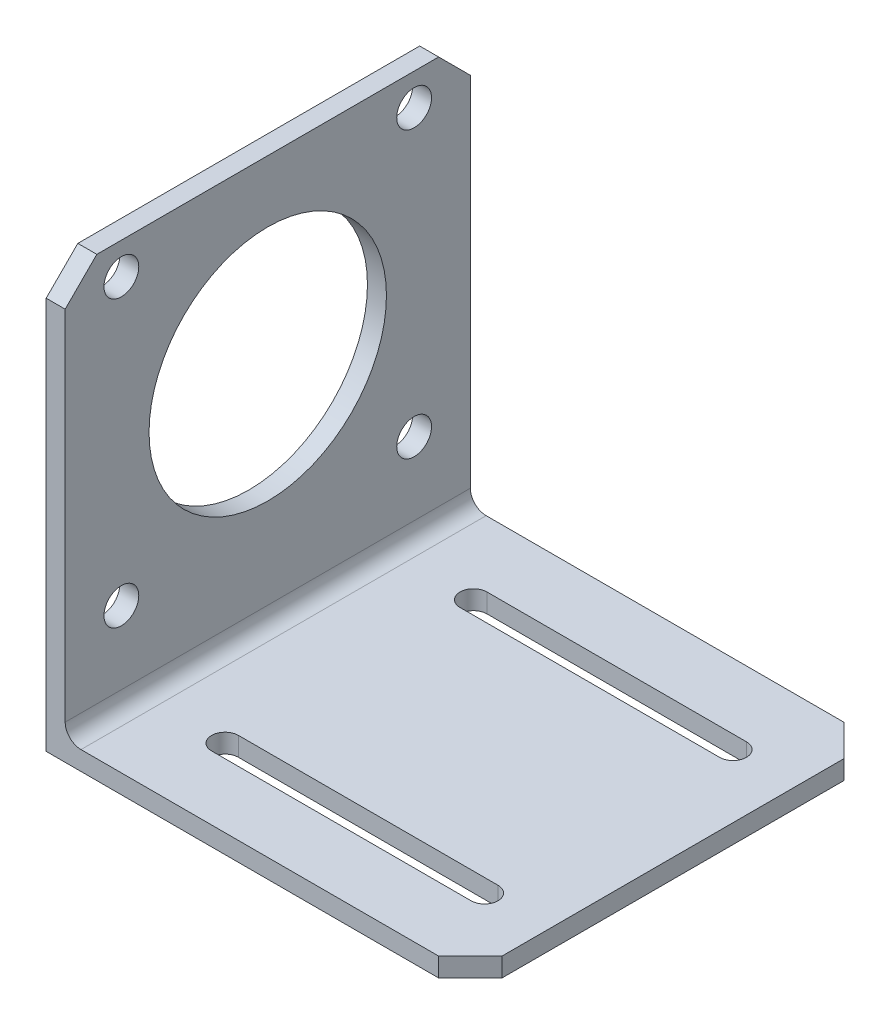
ISO-10303-21;
HEADER;
FILE_DESCRIPTION(('STEP AP214'),'2;1');
FILE_NAME('part.step','',(''),(''),'','','');
FILE_SCHEMA(('AUTOMOTIVE_DESIGN { 1 0 10303 214 1 1 1 1 }'));
ENDSEC;
DATA;
#1=APPLICATION_CONTEXT('core data for automotive mechanical design processes');
#2=APPLICATION_PROTOCOL_DEFINITION('international standard','automotive_design',2000,#1);
#3=PRODUCT_CONTEXT('',#1,'mechanical');
#4=PRODUCT('Part','Part','',(#3));
#5=PRODUCT_RELATED_PRODUCT_CATEGORY('part','',(#4));
#6=PRODUCT_DEFINITION_FORMATION('','',#4);
#7=PRODUCT_DEFINITION_CONTEXT('part definition',#1,'design');
#8=PRODUCT_DEFINITION('design','',#6,#7);
#9=PRODUCT_DEFINITION_SHAPE('','',#8);
#10=(LENGTH_UNIT() NAMED_UNIT(*) SI_UNIT(.MILLI.,.METRE.));
#11=(NAMED_UNIT(*) PLANE_ANGLE_UNIT() SI_UNIT($,.RADIAN.));
#12=(NAMED_UNIT(*) SI_UNIT($,.STERADIAN.) SOLID_ANGLE_UNIT());
#13=UNCERTAINTY_MEASURE_WITH_UNIT(LENGTH_MEASURE(1.E-05),#10,'distance_accuracy_value','');
#14=(GEOMETRIC_REPRESENTATION_CONTEXT(3) GLOBAL_UNCERTAINTY_ASSIGNED_CONTEXT((#13)) GLOBAL_UNIT_ASSIGNED_CONTEXT((#10,
#11,#12)) REPRESENTATION_CONTEXT('',''));
#15=CARTESIAN_POINT('',(0.,0.,0.));
#16=DIRECTION('',(0.,0.,1.));
#17=DIRECTION('',(1.,0.,0.));
#18=AXIS2_PLACEMENT_3D('',#15,#16,#17);
#19=CARTESIAN_POINT('',(1.524,-32.512,-65.024));
#20=DIRECTION('',(0.,1.,0.));
#21=DIRECTION('',(-1.,0.,0.));
#22=AXIS2_PLACEMENT_3D('',#19,#20,#21);
#23=PLANE('',#22);
#24=CARTESIAN_POINT('',(14.732,-32.512,-52.324));
#25=DIRECTION('',(0.,1.,0.));
#26=DIRECTION('',(1.,0.,0.));
#27=AXIS2_PLACEMENT_3D('',#24,#25,#26);
#28=CIRCLE('',#27,2.159);
#29=CARTESIAN_POINT('',(14.732,-32.512,-54.483));
#30=VERTEX_POINT('',#29);
#31=CARTESIAN_POINT('',(14.732,-32.512,-50.165));
#32=VERTEX_POINT('',#31);
#33=EDGE_CURVE('E186',#30,#32,#28,.T.);
#34=ORIENTED_EDGE('',*,*,#33,.F.);
#35=DIRECTION('',(-1.,0.,0.));
#36=VECTOR('',#35,1.);
#37=CARTESIAN_POINT('',(14.732,-32.512,-54.483));
#38=LINE('',#37,#36);
#39=CARTESIAN_POINT('',(56.388,-32.512,-54.483));
#40=VERTEX_POINT('',#39);
#41=EDGE_CURVE('E190',#40,#30,#38,.T.);
#42=ORIENTED_EDGE('',*,*,#41,.F.);
#43=CARTESIAN_POINT('',(56.388,-32.512,-52.324));
#44=DIRECTION('',(0.,1.,0.));
#45=DIRECTION('',(1.,0.,0.));
#46=AXIS2_PLACEMENT_3D('',#43,#44,#45);
#47=CIRCLE('',#46,2.159);
#48=CARTESIAN_POINT('',(56.388,-32.512,-50.165));
#49=VERTEX_POINT('',#48);
#50=EDGE_CURVE('E170',#49,#40,#47,.T.);
#51=ORIENTED_EDGE('',*,*,#50,.F.);
#52=DIRECTION('',(1.,0.,0.));
#53=VECTOR('',#52,1.);
#54=CARTESIAN_POINT('',(14.732,-32.512,-50.165));
#55=LINE('',#54,#53);
#56=EDGE_CURVE('E181',#32,#49,#55,.T.);
#57=ORIENTED_EDGE('',*,*,#56,.F.);
#58=EDGE_LOOP('',(#34,#42,#51,#57));
#59=FACE_BOUND('',#58,.T.);
#60=CARTESIAN_POINT('',(14.732,-32.512,-12.446));
#61=DIRECTION('',(0.,1.,0.));
#62=DIRECTION('',(-1.,0.,0.));
#63=AXIS2_PLACEMENT_3D('',#60,#61,#62);
#64=CIRCLE('',#63,2.159);
#65=CARTESIAN_POINT('',(14.732,-32.512,-14.605));
#66=VERTEX_POINT('',#65);
#67=CARTESIAN_POINT('',(14.732,-32.512,-10.287));
#68=VERTEX_POINT('',#67);
#69=EDGE_CURVE('E197',#66,#68,#64,.T.);
#70=ORIENTED_EDGE('',*,*,#69,.F.);
#71=DIRECTION('',(-1.,0.,0.));
#72=VECTOR('',#71,1.);
#73=CARTESIAN_POINT('',(14.732,-32.512,-14.605));
#74=LINE('',#73,#72);
#75=CARTESIAN_POINT('',(56.388,-32.512,-14.605));
#76=VERTEX_POINT('',#75);
#77=EDGE_CURVE('E207',#76,#66,#74,.T.);
#78=ORIENTED_EDGE('',*,*,#77,.F.);
#79=CARTESIAN_POINT('',(56.388,-32.512,-12.446));
#80=DIRECTION('',(0.,1.,0.));
#81=DIRECTION('',(1.,0.,0.));
#82=AXIS2_PLACEMENT_3D('',#79,#80,#81);
#83=CIRCLE('',#82,2.159);
#84=CARTESIAN_POINT('',(56.388,-32.512,-10.287));
#85=VERTEX_POINT('',#84);
#86=EDGE_CURVE('E204',#85,#76,#83,.T.);
#87=ORIENTED_EDGE('',*,*,#86,.F.);
#88=DIRECTION('',(1.,0.,0.));
#89=VECTOR('',#88,1.);
#90=CARTESIAN_POINT('',(14.732,-32.512,-10.287));
#91=LINE('',#90,#89);
#92=EDGE_CURVE('E201',#68,#85,#91,.T.);
#93=ORIENTED_EDGE('',*,*,#92,.F.);
#94=EDGE_LOOP('',(#70,#78,#87,#93));
#95=FACE_BOUND('',#94,.T.);
#96=DIRECTION('',(0.,0.,1.));
#97=VECTOR('',#96,1.);
#98=CARTESIAN_POINT('',(66.548,-32.512,-65.024));
#99=LINE('',#98,#97);
#100=CARTESIAN_POINT('',(66.548,-32.512,-59.944));
#101=VERTEX_POINT('',#100);
#102=CARTESIAN_POINT('',(66.548,-32.512,-5.08000000000003));
#103=VERTEX_POINT('',#102);
#104=EDGE_CURVE('E240',#101,#103,#99,.T.);
#105=ORIENTED_EDGE('',*,*,#104,.F.);
#106=DIRECTION('',(0.707106781186548,0.,0.707106781186547));
#107=VECTOR('',#106,1.);
#108=CARTESIAN_POINT('',(31.4959999999999,-32.512,-94.996));
#109=LINE('',#108,#107);
#110=CARTESIAN_POINT('',(61.468,-32.512,-65.024));
#111=VERTEX_POINT('',#110);
#112=EDGE_CURVE('E56',#101,#111,#109,.F.);
#113=ORIENTED_EDGE('',*,*,#112,.T.);
#114=DIRECTION('',(-1.,0.,0.));
#115=VECTOR('',#114,1.);
#116=CARTESIAN_POINT('',(1.524,-32.512,-65.024));
#117=LINE('',#116,#115);
#118=CARTESIAN_POINT('',(4.064,-32.512,-65.024));
#119=VERTEX_POINT('',#118);
#120=EDGE_CURVE('E220',#111,#119,#117,.T.);
#121=ORIENTED_EDGE('',*,*,#120,.T.);
#122=DIRECTION('',(0.,0.,1.));
#123=VECTOR('',#122,1.);
#124=CARTESIAN_POINT('',(4.064,-32.512,0.));
#125=LINE('',#124,#123);
#126=CARTESIAN_POINT('',(4.064,-32.512,0.));
#127=VERTEX_POINT('',#126);
#128=EDGE_CURVE('E269',#119,#127,#125,.T.);
#129=ORIENTED_EDGE('',*,*,#128,.T.);
#130=DIRECTION('',(-1.,0.,0.));
#131=VECTOR('',#130,1.);
#132=CARTESIAN_POINT('',(1.524,-32.512,0.));
#133=LINE('',#132,#131);
#134=CARTESIAN_POINT('',(61.468,-32.512,0.));
#135=VERTEX_POINT('',#134);
#136=EDGE_CURVE('E213',#135,#127,#133,.T.);
#137=ORIENTED_EDGE('',*,*,#136,.F.);
#138=DIRECTION('',(0.707106781186547,0.,-0.707106781186549));
#139=VECTOR('',#138,1.);
#140=CARTESIAN_POINT('',(64.0080000000001,-32.512,-2.54000000000008));
#141=LINE('',#140,#139);
#142=EDGE_CURVE('E48',#135,#103,#141,.T.);
#143=ORIENTED_EDGE('',*,*,#142,.T.);
#144=EDGE_LOOP('',(#105,#113,#121,#129,#137,#143));
#145=FACE_BOUND('',#144,.T.);
#146=ADVANCED_FACE('F33',(#59,#95,#145),#23,.T.);
#147=CARTESIAN_POINT('',(66.548,-32.512,-65.024));
#148=DIRECTION('',(1.,0.,0.));
#149=DIRECTION('',(0.,0.,-1.));
#150=AXIS2_PLACEMENT_3D('',#147,#148,#149);
#151=PLANE('',#150);
#152=DIRECTION('',(0.,0.,1.));
#153=VECTOR('',#152,1.);
#154=CARTESIAN_POINT('',(66.548,-35.56,-65.024));
#155=LINE('',#154,#153);
#156=CARTESIAN_POINT('',(66.548,-35.56,-59.944));
#157=VERTEX_POINT('',#156);
#158=CARTESIAN_POINT('',(66.548,-35.56,-5.08000000000003));
#159=VERTEX_POINT('',#158);
#160=EDGE_CURVE('E243',#157,#159,#155,.T.);
#161=ORIENTED_EDGE('',*,*,#160,.F.);
#162=DIRECTION('',(0.,1.,0.));
#163=VECTOR('',#162,1.);
#164=CARTESIAN_POINT('',(66.548,-32.512,-59.944));
#165=LINE('',#164,#163);
#166=EDGE_CURVE('E324',#157,#101,#165,.T.);
#167=ORIENTED_EDGE('',*,*,#166,.T.);
#168=ORIENTED_EDGE('',*,*,#104,.T.);
#169=DIRECTION('',(0.,-1.,0.));
#170=VECTOR('',#169,1.);
#171=CARTESIAN_POINT('',(66.548,-35.56,-5.08000000000003));
#172=LINE('',#171,#170);
#173=EDGE_CURVE('E322',#103,#159,#172,.T.);
#174=ORIENTED_EDGE('',*,*,#173,.T.);
#175=EDGE_LOOP('',(#161,#167,#168,#174));
#176=FACE_BOUND('',#175,.T.);
#177=ADVANCED_FACE('F340',(#176),#151,.T.);
#178=CARTESIAN_POINT('',(-1.524,-35.56,-65.024));
#179=DIRECTION('',(0.,-1.,0.));
#180=DIRECTION('',(0.,0.,-1.));
#181=AXIS2_PLACEMENT_3D('',#178,#179,#180);
#182=PLANE('',#181);
#183=CARTESIAN_POINT('',(14.732,-35.56,-52.324));
#184=DIRECTION('',(0.,-1.,0.));
#185=DIRECTION('',(0.,0.,-1.));
#186=AXIS2_PLACEMENT_3D('',#183,#184,#185);
#187=CIRCLE('',#186,2.159);
#188=CARTESIAN_POINT('',(14.732,-35.56,-50.165));
#189=VERTEX_POINT('',#188);
#190=CARTESIAN_POINT('',(14.732,-35.56,-54.483));
#191=VERTEX_POINT('',#190);
#192=EDGE_CURVE('E267',#189,#191,#187,.T.);
#193=ORIENTED_EDGE('',*,*,#192,.F.);
#194=DIRECTION('',(-1.,0.,0.));
#195=VECTOR('',#194,1.);
#196=CARTESIAN_POINT('',(-1.524,-35.56,-50.165));
#197=LINE('',#196,#195);
#198=CARTESIAN_POINT('',(56.388,-35.56,-50.165));
#199=VERTEX_POINT('',#198);
#200=EDGE_CURVE('E262',#199,#189,#197,.T.);
#201=ORIENTED_EDGE('',*,*,#200,.F.);
#202=CARTESIAN_POINT('',(56.388,-35.56,-52.324));
#203=DIRECTION('',(0.,-1.,0.));
#204=DIRECTION('',(0.,0.,-1.));
#205=AXIS2_PLACEMENT_3D('',#202,#203,#204);
#206=CIRCLE('',#205,2.159);
#207=CARTESIAN_POINT('',(56.388,-35.56,-54.483));
#208=VERTEX_POINT('',#207);
#209=EDGE_CURVE('E173',#208,#199,#206,.T.);
#210=ORIENTED_EDGE('',*,*,#209,.F.);
#211=DIRECTION('',(1.,0.,0.));
#212=VECTOR('',#211,1.);
#213=CARTESIAN_POINT('',(-1.524,-35.56,-54.483));
#214=LINE('',#213,#212);
#215=EDGE_CURVE('E265',#191,#208,#214,.T.);
#216=ORIENTED_EDGE('',*,*,#215,.F.);
#217=EDGE_LOOP('',(#193,#201,#210,#216));
#218=FACE_BOUND('',#217,.T.);
#219=CARTESIAN_POINT('',(14.732,-35.56,-12.446));
#220=DIRECTION('',(0.,-1.,0.));
#221=DIRECTION('',(0.,0.,-1.));
#222=AXIS2_PLACEMENT_3D('',#219,#220,#221);
#223=CIRCLE('',#222,2.159);
#224=CARTESIAN_POINT('',(14.732,-35.56,-10.287));
#225=VERTEX_POINT('',#224);
#226=CARTESIAN_POINT('',(14.732,-35.56,-14.605));
#227=VERTEX_POINT('',#226);
#228=EDGE_CURVE('E260',#225,#227,#223,.T.);
#229=ORIENTED_EDGE('',*,*,#228,.F.);
#230=DIRECTION('',(-1.,0.,0.));
#231=VECTOR('',#230,1.);
#232=CARTESIAN_POINT('',(-1.524,-35.56,-10.287));
#233=LINE('',#232,#231);
#234=CARTESIAN_POINT('',(56.388,-35.56,-10.287));
#235=VERTEX_POINT('',#234);
#236=EDGE_CURVE('E242',#235,#225,#233,.T.);
#237=ORIENTED_EDGE('',*,*,#236,.F.);
#238=CARTESIAN_POINT('',(56.388,-35.56,-12.446));
#239=DIRECTION('',(0.,-1.,0.));
#240=DIRECTION('',(0.,0.,-1.));
#241=AXIS2_PLACEMENT_3D('',#238,#239,#240);
#242=CIRCLE('',#241,2.159);
#243=CARTESIAN_POINT('',(56.388,-35.56,-14.605));
#244=VERTEX_POINT('',#243);
#245=EDGE_CURVE('E255',#244,#235,#242,.T.);
#246=ORIENTED_EDGE('',*,*,#245,.F.);
#247=DIRECTION('',(1.,0.,0.));
#248=VECTOR('',#247,1.);
#249=CARTESIAN_POINT('',(-1.524,-35.56,-14.605));
#250=LINE('',#249,#248);
#251=EDGE_CURVE('E258',#227,#244,#250,.T.);
#252=ORIENTED_EDGE('',*,*,#251,.F.);
#253=EDGE_LOOP('',(#229,#237,#246,#252));
#254=FACE_BOUND('',#253,.T.);
#255=DIRECTION('',(1.,0.,0.));
#256=VECTOR('',#255,1.);
#257=CARTESIAN_POINT('',(-1.524,-35.56,-65.024));
#258=LINE('',#257,#256);
#259=CARTESIAN_POINT('',(-1.524,-35.56,-65.024));
#260=VERTEX_POINT('',#259);
#261=CARTESIAN_POINT('',(61.468,-35.56,-65.024));
#262=VERTEX_POINT('',#261);
#263=EDGE_CURVE('E228',#260,#262,#258,.T.);
#264=ORIENTED_EDGE('',*,*,#263,.T.);
#265=DIRECTION('',(-0.707106781186548,0.,-0.707106781186547));
#266=VECTOR('',#265,1.);
#267=CARTESIAN_POINT('',(29.9719999999999,-35.56,-96.52));
#268=LINE('',#267,#266);
#269=EDGE_CURVE('E11',#262,#157,#268,.F.);
#270=ORIENTED_EDGE('',*,*,#269,.T.);
#271=ORIENTED_EDGE('',*,*,#160,.T.);
#272=DIRECTION('',(-0.707106781186547,0.,0.707106781186549));
#273=VECTOR('',#272,1.);
#274=CARTESIAN_POINT('',(62.4840000000001,-35.56,-1.01600000000009));
#275=LINE('',#274,#273);
#276=CARTESIAN_POINT('',(61.468,-35.56,0.));
#277=VERTEX_POINT('',#276);
#278=EDGE_CURVE('E41',#159,#277,#275,.T.);
#279=ORIENTED_EDGE('',*,*,#278,.T.);
#280=DIRECTION('',(1.,0.,0.));
#281=VECTOR('',#280,1.);
#282=CARTESIAN_POINT('',(-1.524,-35.56,0.));
#283=LINE('',#282,#281);
#284=CARTESIAN_POINT('',(-1.524,-35.56,0.));
#285=VERTEX_POINT('',#284);
#286=EDGE_CURVE('E223',#285,#277,#283,.T.);
#287=ORIENTED_EDGE('',*,*,#286,.F.);
#288=DIRECTION('',(0.,0.,1.));
#289=VECTOR('',#288,1.);
#290=CARTESIAN_POINT('',(-1.524,-35.56,-65.024));
#291=LINE('',#290,#289);
#292=EDGE_CURVE('E246',#260,#285,#291,.T.);
#293=ORIENTED_EDGE('',*,*,#292,.F.);
#294=EDGE_LOOP('',(#264,#270,#271,#279,#287,#293));
#295=FACE_BOUND('',#294,.T.);
#296=ADVANCED_FACE('F330',(#218,#254,#295),#182,.T.);
#297=CARTESIAN_POINT('',(-1.52399999999999,-32.512,-65.024));
#298=DIRECTION('',(-1.,0.,0.));
#299=DIRECTION('',(0.,-1.,0.));
#300=AXIS2_PLACEMENT_3D('',#297,#298,#299);
#301=PLANE('',#300);
#302=CARTESIAN_POINT('',(-1.52399999999999,27.432,-56.007));
#303=DIRECTION('',(-1.,0.,0.));
#304=DIRECTION('',(0.,-1.,0.));
#305=AXIS2_PLACEMENT_3D('',#302,#303,#304);
#306=CIRCLE('',#305,2.794);
#307=CARTESIAN_POINT('',(-1.52399999999999,24.638,-56.007));
#308=VERTEX_POINT('',#307);
#309=EDGE_CURVE('E289',#308,#308,#306,.T.);
#310=ORIENTED_EDGE('',*,*,#309,.F.);
#311=EDGE_LOOP('',(#310));
#312=FACE_BOUND('',#311,.T.);
#313=CARTESIAN_POINT('',(-1.52399999999999,27.432,-9.017));
#314=DIRECTION('',(-1.,0.,0.));
#315=DIRECTION('',(0.,-1.,0.));
#316=AXIS2_PLACEMENT_3D('',#313,#314,#315);
#317=CIRCLE('',#316,2.794);
#318=CARTESIAN_POINT('',(-1.52399999999999,24.638,-9.017));
#319=VERTEX_POINT('',#318);
#320=EDGE_CURVE('E285',#319,#319,#317,.T.);
#321=ORIENTED_EDGE('',*,*,#320,.F.);
#322=EDGE_LOOP('',(#321));
#323=FACE_BOUND('',#322,.T.);
#324=CARTESIAN_POINT('',(-1.52399999999999,-18.288,-9.017));
#325=DIRECTION('',(-1.,0.,0.));
#326=DIRECTION('',(0.,-1.,0.));
#327=AXIS2_PLACEMENT_3D('',#324,#325,#326);
#328=CIRCLE('',#327,2.794);
#329=CARTESIAN_POINT('',(-1.52399999999999,-21.082,-9.017));
#330=VERTEX_POINT('',#329);
#331=EDGE_CURVE('E281',#330,#330,#328,.T.);
#332=ORIENTED_EDGE('',*,*,#331,.F.);
#333=EDGE_LOOP('',(#332));
#334=FACE_BOUND('',#333,.T.);
#335=CARTESIAN_POINT('',(-1.52399999999999,-18.288,-56.007));
#336=DIRECTION('',(-1.,0.,0.));
#337=DIRECTION('',(0.,-1.,0.));
#338=AXIS2_PLACEMENT_3D('',#335,#336,#337);
#339=CIRCLE('',#338,2.794);
#340=CARTESIAN_POINT('',(-1.52399999999999,-21.082,-56.007));
#341=VERTEX_POINT('',#340);
#342=EDGE_CURVE('E277',#341,#341,#339,.T.);
#343=ORIENTED_EDGE('',*,*,#342,.F.);
#344=EDGE_LOOP('',(#343));
#345=FACE_BOUND('',#344,.T.);
#346=CARTESIAN_POINT('',(-1.52399999999999,3.556,-32.512));
#347=DIRECTION('',(-1.,0.,0.));
#348=DIRECTION('',(0.,-1.,0.));
#349=AXIS2_PLACEMENT_3D('',#346,#347,#348);
#350=CIRCLE('',#349,19.05);
#351=CARTESIAN_POINT('',(-1.52399999999999,-15.494,-32.512));
#352=VERTEX_POINT('',#351);
#353=EDGE_CURVE('E273',#352,#352,#350,.T.);
#354=ORIENTED_EDGE('',*,*,#353,.F.);
#355=EDGE_LOOP('',(#354));
#356=FACE_BOUND('',#355,.T.);
#357=DIRECTION('',(0.,-1.,0.));
#358=VECTOR('',#357,1.);
#359=CARTESIAN_POINT('',(-1.52399999999999,-32.512,0.));
#360=LINE('',#359,#358);
#361=CARTESIAN_POINT('',(-1.52399999999999,27.432,0.));
#362=VERTEX_POINT('',#361);
#363=EDGE_CURVE('E236',#362,#285,#360,.T.);
#364=ORIENTED_EDGE('',*,*,#363,.F.);
#365=DIRECTION('',(0.,0.707106781186547,-0.707106781186548));
#366=VECTOR('',#365,1.);
#367=CARTESIAN_POINT('',(-1.52399999999999,29.9720000000001,-2.54000000000009));
#368=LINE('',#367,#366);
#369=CARTESIAN_POINT('',(-1.524,32.512,-5.08000000000002));
#370=VERTEX_POINT('',#369);
#371=EDGE_CURVE('E307',#362,#370,#368,.T.);
#372=ORIENTED_EDGE('',*,*,#371,.T.);
#373=DIRECTION('',(0.,0.,1.));
#374=VECTOR('',#373,1.);
#375=CARTESIAN_POINT('',(-1.524,32.512,-65.024));
#376=LINE('',#375,#374);
#377=CARTESIAN_POINT('',(-1.524,32.512,-59.944));
#378=VERTEX_POINT('',#377);
#379=EDGE_CURVE('E249',#378,#370,#376,.T.);
#380=ORIENTED_EDGE('',*,*,#379,.F.);
#381=DIRECTION('',(0.,0.707106781186548,0.707106781186547));
#382=VECTOR('',#381,1.);
#383=CARTESIAN_POINT('',(-1.52399999999999,-2.54000000000009,-94.996));
#384=LINE('',#383,#382);
#385=CARTESIAN_POINT('',(-1.524,27.432,-65.024));
#386=VERTEX_POINT('',#385);
#387=EDGE_CURVE('E305',#378,#386,#384,.F.);
#388=ORIENTED_EDGE('',*,*,#387,.T.);
#389=DIRECTION('',(0.,-1.,0.));
#390=VECTOR('',#389,1.);
#391=CARTESIAN_POINT('',(-1.524,32.512,-65.024));
#392=LINE('',#391,#390);
#393=EDGE_CURVE('E226',#386,#260,#392,.T.);
#394=ORIENTED_EDGE('',*,*,#393,.T.);
#395=ORIENTED_EDGE('',*,*,#292,.T.);
#396=EDGE_LOOP('',(#364,#372,#380,#388,#394,#395));
#397=FACE_BOUND('',#396,.T.);
#398=ADVANCED_FACE('F396',(#312,#323,#334,#345,#356,#397),#301,.T.);
#399=CARTESIAN_POINT('',(-1.524,32.512,-65.024));
#400=DIRECTION('',(0.,1.,0.));
#401=DIRECTION('',(0.,0.,1.));
#402=AXIS2_PLACEMENT_3D('',#399,#400,#401);
#403=PLANE('',#402);
#404=ORIENTED_EDGE('',*,*,#379,.T.);
#405=DIRECTION('',(1.,0.,0.));
#406=VECTOR('',#405,1.);
#407=CARTESIAN_POINT('',(1.524,32.512,-5.08000000000002));
#408=LINE('',#407,#406);
#409=CARTESIAN_POINT('',(1.524,32.512,-5.08000000000003));
#410=VERTEX_POINT('',#409);
#411=EDGE_CURVE('E312',#370,#410,#408,.T.);
#412=ORIENTED_EDGE('',*,*,#411,.T.);
#413=DIRECTION('',(0.,0.,1.));
#414=VECTOR('',#413,1.);
#415=CARTESIAN_POINT('',(1.524,32.512,-65.024));
#416=LINE('',#415,#414);
#417=CARTESIAN_POINT('',(1.524,32.512,-59.944));
#418=VERTEX_POINT('',#417);
#419=EDGE_CURVE('E231',#418,#410,#416,.T.);
#420=ORIENTED_EDGE('',*,*,#419,.F.);
#421=DIRECTION('',(-1.,0.,0.));
#422=VECTOR('',#421,1.);
#423=CARTESIAN_POINT('',(-1.524,32.512,-59.944));
#424=LINE('',#423,#422);
#425=EDGE_CURVE('E309',#418,#378,#424,.T.);
#426=ORIENTED_EDGE('',*,*,#425,.T.);
#427=EDGE_LOOP('',(#404,#412,#420,#426));
#428=FACE_BOUND('',#427,.T.);
#429=ADVANCED_FACE('F362',(#428),#403,.T.);
#430=CARTESIAN_POINT('',(1.524,32.512,-65.024));
#431=DIRECTION('',(1.,0.,0.));
#432=DIRECTION('',(0.,1.,0.));
#433=AXIS2_PLACEMENT_3D('',#430,#431,#432);
#434=PLANE('',#433);
#435=CARTESIAN_POINT('',(1.524,27.432,-56.007));
#436=DIRECTION('',(1.,0.,0.));
#437=DIRECTION('',(0.,1.,0.));
#438=AXIS2_PLACEMENT_3D('',#435,#436,#437);
#439=CIRCLE('',#438,2.794);
#440=CARTESIAN_POINT('',(1.524,30.226,-56.007));
#441=VERTEX_POINT('',#440);
#442=EDGE_CURVE('E286',#441,#441,#439,.T.);
#443=ORIENTED_EDGE('',*,*,#442,.F.);
#444=EDGE_LOOP('',(#443));
#445=FACE_BOUND('',#444,.T.);
#446=CARTESIAN_POINT('',(1.524,27.432,-9.017));
#447=DIRECTION('',(1.,0.,0.));
#448=DIRECTION('',(0.,1.,0.));
#449=AXIS2_PLACEMENT_3D('',#446,#447,#448);
#450=CIRCLE('',#449,2.794);
#451=CARTESIAN_POINT('',(1.524,30.226,-9.017));
#452=VERTEX_POINT('',#451);
#453=EDGE_CURVE('E282',#452,#452,#450,.T.);
#454=ORIENTED_EDGE('',*,*,#453,.F.);
#455=EDGE_LOOP('',(#454));
#456=FACE_BOUND('',#455,.T.);
#457=CARTESIAN_POINT('',(1.524,-18.288,-9.017));
#458=DIRECTION('',(1.,0.,0.));
#459=DIRECTION('',(0.,1.,0.));
#460=AXIS2_PLACEMENT_3D('',#457,#458,#459);
#461=CIRCLE('',#460,2.794);
#462=CARTESIAN_POINT('',(1.524,-15.494,-9.017));
#463=VERTEX_POINT('',#462);
#464=EDGE_CURVE('E278',#463,#463,#461,.T.);
#465=ORIENTED_EDGE('',*,*,#464,.F.);
#466=EDGE_LOOP('',(#465));
#467=FACE_BOUND('',#466,.T.);
#468=CARTESIAN_POINT('',(1.524,-18.288,-56.007));
#469=DIRECTION('',(1.,0.,0.));
#470=DIRECTION('',(0.,1.,0.));
#471=AXIS2_PLACEMENT_3D('',#468,#469,#470);
#472=CIRCLE('',#471,2.794);
#473=CARTESIAN_POINT('',(1.524,-15.494,-56.007));
#474=VERTEX_POINT('',#473);
#475=EDGE_CURVE('E274',#474,#474,#472,.T.);
#476=ORIENTED_EDGE('',*,*,#475,.F.);
#477=EDGE_LOOP('',(#476));
#478=FACE_BOUND('',#477,.T.);
#479=CARTESIAN_POINT('',(1.524,3.556,-32.512));
#480=DIRECTION('',(1.,0.,0.));
#481=DIRECTION('',(0.,1.,0.));
#482=AXIS2_PLACEMENT_3D('',#479,#480,#481);
#483=CIRCLE('',#482,19.05);
#484=CARTESIAN_POINT('',(1.524,22.606,-32.512));
#485=VERTEX_POINT('',#484);
#486=EDGE_CURVE('E270',#485,#485,#483,.T.);
#487=ORIENTED_EDGE('',*,*,#486,.F.);
#488=EDGE_LOOP('',(#487));
#489=FACE_BOUND('',#488,.T.);
#490=ORIENTED_EDGE('',*,*,#419,.T.);
#491=DIRECTION('',(0.,-0.707106781186547,0.707106781186548));
#492=VECTOR('',#491,1.);
#493=CARTESIAN_POINT('',(1.52399999999999,62.484,-35.0520000000001));
#494=LINE('',#493,#492);
#495=CARTESIAN_POINT('',(1.524,27.432,0.));
#496=VERTEX_POINT('',#495);
#497=EDGE_CURVE('E316',#410,#496,#494,.T.);
#498=ORIENTED_EDGE('',*,*,#497,.T.);
#499=DIRECTION('',(0.,1.,0.));
#500=VECTOR('',#499,1.);
#501=CARTESIAN_POINT('',(1.524,32.512,0.));
#502=LINE('',#501,#500);
#503=CARTESIAN_POINT('',(1.524,-29.972,0.));
#504=VERTEX_POINT('',#503);
#505=EDGE_CURVE('E233',#504,#496,#502,.T.);
#506=ORIENTED_EDGE('',*,*,#505,.F.);
#507=DIRECTION('',(0.,0.,1.));
#508=VECTOR('',#507,1.);
#509=CARTESIAN_POINT('',(1.524,-29.972,-65.024));
#510=LINE('',#509,#508);
#511=CARTESIAN_POINT('',(1.524,-29.972,-65.024));
#512=VERTEX_POINT('',#511);
#513=EDGE_CURVE('E292',#504,#512,#510,.F.);
#514=ORIENTED_EDGE('',*,*,#513,.T.);
#515=DIRECTION('',(0.,1.,0.));
#516=VECTOR('',#515,1.);
#517=CARTESIAN_POINT('',(1.524,32.512,-65.024));
#518=LINE('',#517,#516);
#519=CARTESIAN_POINT('',(1.524,27.432,-65.024));
#520=VERTEX_POINT('',#519);
#521=EDGE_CURVE('E222',#512,#520,#518,.T.);
#522=ORIENTED_EDGE('',*,*,#521,.T.);
#523=DIRECTION('',(0.,-0.707106781186548,-0.707106781186547));
#524=VECTOR('',#523,1.);
#525=CARTESIAN_POINT('',(1.524,29.972,-62.484));
#526=LINE('',#525,#524);
#527=EDGE_CURVE('E314',#520,#418,#526,.F.);
#528=ORIENTED_EDGE('',*,*,#527,.T.);
#529=EDGE_LOOP('',(#490,#498,#506,#514,#522,#528));
#530=FACE_BOUND('',#529,.T.);
#531=ADVANCED_FACE('F359',(#445,#456,#467,#478,#489,#530),#434,.T.);
#532=CARTESIAN_POINT('',(0.,0.,-65.024));
#533=DIRECTION('',(0.,0.,-1.));
#534=DIRECTION('',(-1.,0.,0.));
#535=AXIS2_PLACEMENT_3D('',#532,#533,#534);
#536=PLANE('',#535);
#537=ORIENTED_EDGE('',*,*,#393,.F.);
#538=DIRECTION('',(1.,0.,0.));
#539=VECTOR('',#538,1.);
#540=CARTESIAN_POINT('',(0.,27.432,-65.024));
#541=LINE('',#540,#539);
#542=EDGE_CURVE('E320',#386,#520,#541,.T.);
#543=ORIENTED_EDGE('',*,*,#542,.T.);
#544=ORIENTED_EDGE('',*,*,#521,.F.);
#545=CARTESIAN_POINT('',(4.064,-29.972,-65.024));
#546=DIRECTION('',(0.,0.,-1.));
#547=DIRECTION('',(-1.,0.,0.));
#548=AXIS2_PLACEMENT_3D('',#545,#546,#547);
#549=CIRCLE('',#548,2.54);
#550=EDGE_CURVE('E296',#512,#119,#549,.F.);
#551=ORIENTED_EDGE('',*,*,#550,.T.);
#552=ORIENTED_EDGE('',*,*,#120,.F.);
#553=DIRECTION('',(0.,-1.,0.));
#554=VECTOR('',#553,1.);
#555=CARTESIAN_POINT('',(61.468,0.,-65.024));
#556=LINE('',#555,#554);
#557=EDGE_CURVE('E318',#111,#262,#556,.T.);
#558=ORIENTED_EDGE('',*,*,#557,.T.);
#559=ORIENTED_EDGE('',*,*,#263,.F.);
#560=EDGE_LOOP('',(#537,#543,#544,#551,#552,#558,#559));
#561=FACE_BOUND('',#560,.T.);
#562=ADVANCED_FACE('F344',(#561),#536,.T.);
#563=CARTESIAN_POINT('',(0.,0.,0.));
#564=DIRECTION('',(0.,0.,-1.));
#565=DIRECTION('',(-1.,0.,0.));
#566=AXIS2_PLACEMENT_3D('',#563,#564,#565);
#567=PLANE('',#566);
#568=ORIENTED_EDGE('',*,*,#505,.T.);
#569=DIRECTION('',(-1.,0.,0.));
#570=VECTOR('',#569,1.);
#571=CARTESIAN_POINT('',(-1.524,27.432,0.));
#572=LINE('',#571,#570);
#573=EDGE_CURVE('E302',#496,#362,#572,.T.);
#574=ORIENTED_EDGE('',*,*,#573,.T.);
#575=ORIENTED_EDGE('',*,*,#363,.T.);
#576=ORIENTED_EDGE('',*,*,#286,.T.);
#577=DIRECTION('',(0.,1.,0.));
#578=VECTOR('',#577,1.);
#579=CARTESIAN_POINT('',(61.468,-32.512,0.));
#580=LINE('',#579,#578);
#581=EDGE_CURVE('E299',#277,#135,#580,.T.);
#582=ORIENTED_EDGE('',*,*,#581,.T.);
#583=ORIENTED_EDGE('',*,*,#136,.T.);
#584=CARTESIAN_POINT('',(4.064,-29.972,0.));
#585=DIRECTION('',(0.,0.,-1.));
#586=DIRECTION('',(-1.,0.,0.));
#587=AXIS2_PLACEMENT_3D('',#584,#585,#586);
#588=CIRCLE('',#587,2.54);
#589=EDGE_CURVE('E294',#127,#504,#588,.T.);
#590=ORIENTED_EDGE('',*,*,#589,.T.);
#591=EDGE_LOOP('',(#568,#574,#575,#576,#582,#583,#590));
#592=FACE_BOUND('',#591,.T.);
#593=ADVANCED_FACE('F337',(#592),#567,.F.);
#594=CARTESIAN_POINT('',(14.732,-97.536,-12.446));
#595=DIRECTION('',(0.,1.,0.));
#596=DIRECTION('',(-1.,0.,0.));
#597=AXIS2_PLACEMENT_3D('',#594,#595,#596);
#598=CYLINDRICAL_SURFACE('',#597,2.159);
#599=ORIENTED_EDGE('',*,*,#228,.T.);
#600=DIRECTION('',(0.,1.,0.));
#601=VECTOR('',#600,1.);
#602=CARTESIAN_POINT('',(14.732,-97.536,-14.605));
#603=LINE('',#602,#601);
#604=EDGE_CURVE('E211',#227,#66,#603,.T.);
#605=ORIENTED_EDGE('',*,*,#604,.T.);
#606=ORIENTED_EDGE('',*,*,#69,.T.);
#607=DIRECTION('',(0.,1.,0.));
#608=VECTOR('',#607,1.);
#609=CARTESIAN_POINT('',(14.732,-97.536,-10.287));
#610=LINE('',#609,#608);
#611=EDGE_CURVE('E210',#225,#68,#610,.T.);
#612=ORIENTED_EDGE('',*,*,#611,.F.);
#613=EDGE_LOOP('',(#599,#605,#606,#612));
#614=FACE_BOUND('',#613,.T.);
#615=ADVANCED_FACE('F405',(#614),#598,.F.);
#616=CARTESIAN_POINT('',(14.732,-97.536,-14.605));
#617=DIRECTION('',(0.,0.,-1.));
#618=DIRECTION('',(-1.,0.,0.));
#619=AXIS2_PLACEMENT_3D('',#616,#617,#618);
#620=PLANE('',#619);
#621=ORIENTED_EDGE('',*,*,#251,.T.);
#622=DIRECTION('',(0.,1.,0.));
#623=VECTOR('',#622,1.);
#624=CARTESIAN_POINT('',(56.388,-97.536,-14.605));
#625=LINE('',#624,#623);
#626=EDGE_CURVE('E214',#244,#76,#625,.T.);
#627=ORIENTED_EDGE('',*,*,#626,.T.);
#628=ORIENTED_EDGE('',*,*,#77,.T.);
#629=ORIENTED_EDGE('',*,*,#604,.F.);
#630=EDGE_LOOP('',(#621,#627,#628,#629));
#631=FACE_BOUND('',#630,.T.);
#632=ADVANCED_FACE('F410',(#631),#620,.F.);
#633=CARTESIAN_POINT('',(56.388,-97.536,-12.446));
#634=DIRECTION('',(0.,1.,0.));
#635=DIRECTION('',(-1.,0.,0.));
#636=AXIS2_PLACEMENT_3D('',#633,#634,#635);
#637=CYLINDRICAL_SURFACE('',#636,2.159);
#638=ORIENTED_EDGE('',*,*,#245,.T.);
#639=DIRECTION('',(0.,1.,0.));
#640=VECTOR('',#639,1.);
#641=CARTESIAN_POINT('',(56.388,-97.536,-10.287));
#642=LINE('',#641,#640);
#643=EDGE_CURVE('E216',#235,#85,#642,.T.);
#644=ORIENTED_EDGE('',*,*,#643,.T.);
#645=ORIENTED_EDGE('',*,*,#86,.T.);
#646=ORIENTED_EDGE('',*,*,#626,.F.);
#647=EDGE_LOOP('',(#638,#644,#645,#646));
#648=FACE_BOUND('',#647,.T.);
#649=ADVANCED_FACE('F416',(#648),#637,.F.);
#650=CARTESIAN_POINT('',(14.732,-97.536,-10.287));
#651=DIRECTION('',(0.,0.,1.));
#652=DIRECTION('',(1.,0.,0.));
#653=AXIS2_PLACEMENT_3D('',#650,#651,#652);
#654=PLANE('',#653);
#655=ORIENTED_EDGE('',*,*,#236,.T.);
#656=ORIENTED_EDGE('',*,*,#611,.T.);
#657=ORIENTED_EDGE('',*,*,#92,.T.);
#658=ORIENTED_EDGE('',*,*,#643,.F.);
#659=EDGE_LOOP('',(#655,#656,#657,#658));
#660=FACE_BOUND('',#659,.T.);
#661=ADVANCED_FACE('F412',(#660),#654,.F.);
#662=CARTESIAN_POINT('',(14.732,-97.536,-52.324));
#663=DIRECTION('',(0.,1.,0.));
#664=DIRECTION('',(-1.,0.,0.));
#665=AXIS2_PLACEMENT_3D('',#662,#663,#664);
#666=CYLINDRICAL_SURFACE('',#665,2.159);
#667=ORIENTED_EDGE('',*,*,#192,.T.);
#668=DIRECTION('',(0.,1.,0.));
#669=VECTOR('',#668,1.);
#670=CARTESIAN_POINT('',(14.732,-97.536,-54.483));
#671=LINE('',#670,#669);
#672=EDGE_CURVE('E195',#191,#30,#671,.T.);
#673=ORIENTED_EDGE('',*,*,#672,.T.);
#674=ORIENTED_EDGE('',*,*,#33,.T.);
#675=DIRECTION('',(0.,1.,0.));
#676=VECTOR('',#675,1.);
#677=CARTESIAN_POINT('',(14.732,-97.536,-50.165));
#678=LINE('',#677,#676);
#679=EDGE_CURVE('E177',#189,#32,#678,.T.);
#680=ORIENTED_EDGE('',*,*,#679,.F.);
#681=EDGE_LOOP('',(#667,#673,#674,#680));
#682=FACE_BOUND('',#681,.T.);
#683=ADVANCED_FACE('F415',(#682),#666,.F.);
#684=CARTESIAN_POINT('',(14.732,-97.536,-54.483));
#685=DIRECTION('',(0.,0.,-1.));
#686=DIRECTION('',(-1.,0.,0.));
#687=AXIS2_PLACEMENT_3D('',#684,#685,#686);
#688=PLANE('',#687);
#689=ORIENTED_EDGE('',*,*,#215,.T.);
#690=DIRECTION('',(0.,1.,0.));
#691=VECTOR('',#690,1.);
#692=CARTESIAN_POINT('',(56.388,-97.536,-54.483));
#693=LINE('',#692,#691);
#694=EDGE_CURVE('E176',#208,#40,#693,.T.);
#695=ORIENTED_EDGE('',*,*,#694,.T.);
#696=ORIENTED_EDGE('',*,*,#41,.T.);
#697=ORIENTED_EDGE('',*,*,#672,.F.);
#698=EDGE_LOOP('',(#689,#695,#696,#697));
#699=FACE_BOUND('',#698,.T.);
#700=ADVANCED_FACE('F426',(#699),#688,.F.);
#701=CARTESIAN_POINT('',(56.388,-97.536,-52.324));
#702=DIRECTION('',(0.,1.,0.));
#703=DIRECTION('',(-1.,0.,0.));
#704=AXIS2_PLACEMENT_3D('',#701,#702,#703);
#705=CYLINDRICAL_SURFACE('',#704,2.159);
#706=ORIENTED_EDGE('',*,*,#209,.T.);
#707=DIRECTION('',(0.,1.,0.));
#708=VECTOR('',#707,1.);
#709=CARTESIAN_POINT('',(56.388,-97.536,-50.165));
#710=LINE('',#709,#708);
#711=EDGE_CURVE('E165',#199,#49,#710,.T.);
#712=ORIENTED_EDGE('',*,*,#711,.T.);
#713=ORIENTED_EDGE('',*,*,#50,.T.);
#714=ORIENTED_EDGE('',*,*,#694,.F.);
#715=EDGE_LOOP('',(#706,#712,#713,#714));
#716=FACE_BOUND('',#715,.T.);
#717=ADVANCED_FACE('F167',(#716),#705,.F.);
#718=CARTESIAN_POINT('',(14.732,-97.536,-50.165));
#719=DIRECTION('',(0.,0.,1.));
#720=DIRECTION('',(1.,0.,0.));
#721=AXIS2_PLACEMENT_3D('',#718,#719,#720);
#722=PLANE('',#721);
#723=ORIENTED_EDGE('',*,*,#200,.T.);
#724=ORIENTED_EDGE('',*,*,#679,.T.);
#725=ORIENTED_EDGE('',*,*,#56,.T.);
#726=ORIENTED_EDGE('',*,*,#711,.F.);
#727=EDGE_LOOP('',(#723,#724,#725,#726));
#728=FACE_BOUND('',#727,.T.);
#729=ADVANCED_FACE('F182',(#728),#722,.F.);
#730=CARTESIAN_POINT('',(63.5,3.556,-32.512));
#731=DIRECTION('',(-1.,0.,0.));
#732=DIRECTION('',(0.,-1.,0.));
#733=AXIS2_PLACEMENT_3D('',#730,#731,#732);
#734=CYLINDRICAL_SURFACE('',#733,19.05);
#735=ORIENTED_EDGE('',*,*,#486,.T.);
#736=EDGE_LOOP('',(#735));
#737=FACE_BOUND('',#736,.T.);
#738=ORIENTED_EDGE('',*,*,#353,.T.);
#739=EDGE_LOOP('',(#738));
#740=FACE_BOUND('',#739,.T.);
#741=ADVANCED_FACE('F430',(#737,#740),#734,.F.);
#742=CARTESIAN_POINT('',(63.5,-18.288,-56.007));
#743=DIRECTION('',(-1.,0.,0.));
#744=DIRECTION('',(0.,-1.,0.));
#745=AXIS2_PLACEMENT_3D('',#742,#743,#744);
#746=CYLINDRICAL_SURFACE('',#745,2.794);
#747=ORIENTED_EDGE('',*,*,#475,.T.);
#748=EDGE_LOOP('',(#747));
#749=FACE_BOUND('',#748,.T.);
#750=ORIENTED_EDGE('',*,*,#342,.T.);
#751=EDGE_LOOP('',(#750));
#752=FACE_BOUND('',#751,.T.);
#753=ADVANCED_FACE('F438',(#749,#752),#746,.F.);
#754=CARTESIAN_POINT('',(63.5,-18.288,-9.017));
#755=DIRECTION('',(-1.,0.,0.));
#756=DIRECTION('',(0.,-1.,0.));
#757=AXIS2_PLACEMENT_3D('',#754,#755,#756);
#758=CYLINDRICAL_SURFACE('',#757,2.794);
#759=ORIENTED_EDGE('',*,*,#464,.T.);
#760=EDGE_LOOP('',(#759));
#761=FACE_BOUND('',#760,.T.);
#762=ORIENTED_EDGE('',*,*,#331,.T.);
#763=EDGE_LOOP('',(#762));
#764=FACE_BOUND('',#763,.T.);
#765=ADVANCED_FACE('F442',(#761,#764),#758,.F.);
#766=CARTESIAN_POINT('',(63.5,27.432,-9.017));
#767=DIRECTION('',(-1.,0.,0.));
#768=DIRECTION('',(0.,-1.,0.));
#769=AXIS2_PLACEMENT_3D('',#766,#767,#768);
#770=CYLINDRICAL_SURFACE('',#769,2.794);
#771=ORIENTED_EDGE('',*,*,#453,.T.);
#772=EDGE_LOOP('',(#771));
#773=FACE_BOUND('',#772,.T.);
#774=ORIENTED_EDGE('',*,*,#320,.T.);
#775=EDGE_LOOP('',(#774));
#776=FACE_BOUND('',#775,.T.);
#777=ADVANCED_FACE('F381',(#773,#776),#770,.F.);
#778=CARTESIAN_POINT('',(63.5,27.432,-56.007));
#779=DIRECTION('',(-1.,0.,0.));
#780=DIRECTION('',(0.,-1.,0.));
#781=AXIS2_PLACEMENT_3D('',#778,#779,#780);
#782=CYLINDRICAL_SURFACE('',#781,2.794);
#783=ORIENTED_EDGE('',*,*,#442,.T.);
#784=EDGE_LOOP('',(#783));
#785=FACE_BOUND('',#784,.T.);
#786=ORIENTED_EDGE('',*,*,#309,.T.);
#787=EDGE_LOOP('',(#786));
#788=FACE_BOUND('',#787,.T.);
#789=ADVANCED_FACE('F374',(#785,#788),#782,.F.);
#790=CARTESIAN_POINT('',(4.064,-29.972,-65.024));
#791=DIRECTION('',(0.,0.,-1.));
#792=DIRECTION('',(-1.,0.,0.));
#793=AXIS2_PLACEMENT_3D('',#790,#791,#792);
#794=CYLINDRICAL_SURFACE('',#793,2.54);
#795=ORIENTED_EDGE('',*,*,#550,.F.);
#796=ORIENTED_EDGE('',*,*,#513,.F.);
#797=ORIENTED_EDGE('',*,*,#589,.F.);
#798=ORIENTED_EDGE('',*,*,#128,.F.);
#799=EDGE_LOOP('',(#795,#796,#797,#798));
#800=FACE_BOUND('',#799,.T.);
#801=ADVANCED_FACE('F372',(#800),#794,.F.);
#802=CARTESIAN_POINT('',(0.,27.432,0.));
#803=DIRECTION('',(0.,0.707106781186548,0.707106781186547));
#804=DIRECTION('',(1.,0.,0.));
#805=AXIS2_PLACEMENT_3D('',#802,#803,#804);
#806=PLANE('',#805);
#807=ORIENTED_EDGE('',*,*,#497,.F.);
#808=ORIENTED_EDGE('',*,*,#411,.F.);
#809=ORIENTED_EDGE('',*,*,#371,.F.);
#810=ORIENTED_EDGE('',*,*,#573,.F.);
#811=EDGE_LOOP('',(#807,#808,#809,#810));
#812=FACE_BOUND('',#811,.T.);
#813=ADVANCED_FACE('F366',(#812),#806,.T.);
#814=CARTESIAN_POINT('',(-1.524,32.512,-59.944));
#815=DIRECTION('',(0.,-0.707106781186547,0.707106781186548));
#816=DIRECTION('',(-1.,0.,0.));
#817=AXIS2_PLACEMENT_3D('',#814,#815,#816);
#818=PLANE('',#817);
#819=ORIENTED_EDGE('',*,*,#527,.F.);
#820=ORIENTED_EDGE('',*,*,#542,.F.);
#821=ORIENTED_EDGE('',*,*,#387,.F.);
#822=ORIENTED_EDGE('',*,*,#425,.F.);
#823=EDGE_LOOP('',(#819,#820,#821,#822));
#824=FACE_BOUND('',#823,.T.);
#825=ADVANCED_FACE('F355',(#824),#818,.F.);
#826=CARTESIAN_POINT('',(66.548,-32.512,-59.944));
#827=DIRECTION('',(-0.707106781186547,0.,0.707106781186548));
#828=DIRECTION('',(0.,1.,0.));
#829=AXIS2_PLACEMENT_3D('',#826,#827,#828);
#830=PLANE('',#829);
#831=ORIENTED_EDGE('',*,*,#269,.F.);
#832=ORIENTED_EDGE('',*,*,#557,.F.);
#833=ORIENTED_EDGE('',*,*,#112,.F.);
#834=ORIENTED_EDGE('',*,*,#166,.F.);
#835=EDGE_LOOP('',(#831,#832,#833,#834));
#836=FACE_BOUND('',#835,.T.);
#837=ADVANCED_FACE('F350',(#836),#830,.F.);
#838=CARTESIAN_POINT('',(61.468,0.,0.));
#839=DIRECTION('',(0.707106781186549,0.,0.707106781186547));
#840=DIRECTION('',(0.,-1.,0.));
#841=AXIS2_PLACEMENT_3D('',#838,#839,#840);
#842=PLANE('',#841);
#843=ORIENTED_EDGE('',*,*,#278,.F.);
#844=ORIENTED_EDGE('',*,*,#173,.F.);
#845=ORIENTED_EDGE('',*,*,#142,.F.);
#846=ORIENTED_EDGE('',*,*,#581,.F.);
#847=EDGE_LOOP('',(#843,#844,#845,#846));
#848=FACE_BOUND('',#847,.T.);
#849=ADVANCED_FACE('F35',(#848),#842,.T.);
#850=CLOSED_SHELL('',(#146,#177,#296,#398,#429,#531,#562,#593,#615,#632,#649,#661,#683,#700,
#717,#729,#741,#753,#765,#777,#789,#801,#813,#825,#837,#849));
#851=MANIFOLD_SOLID_BREP('B2',#850);
#852=ADVANCED_BREP_SHAPE_REPRESENTATION('',(#18,#851),#14);
#853=SHAPE_DEFINITION_REPRESENTATION(#9,#852);
ENDSEC;
END-ISO-10303-21;
